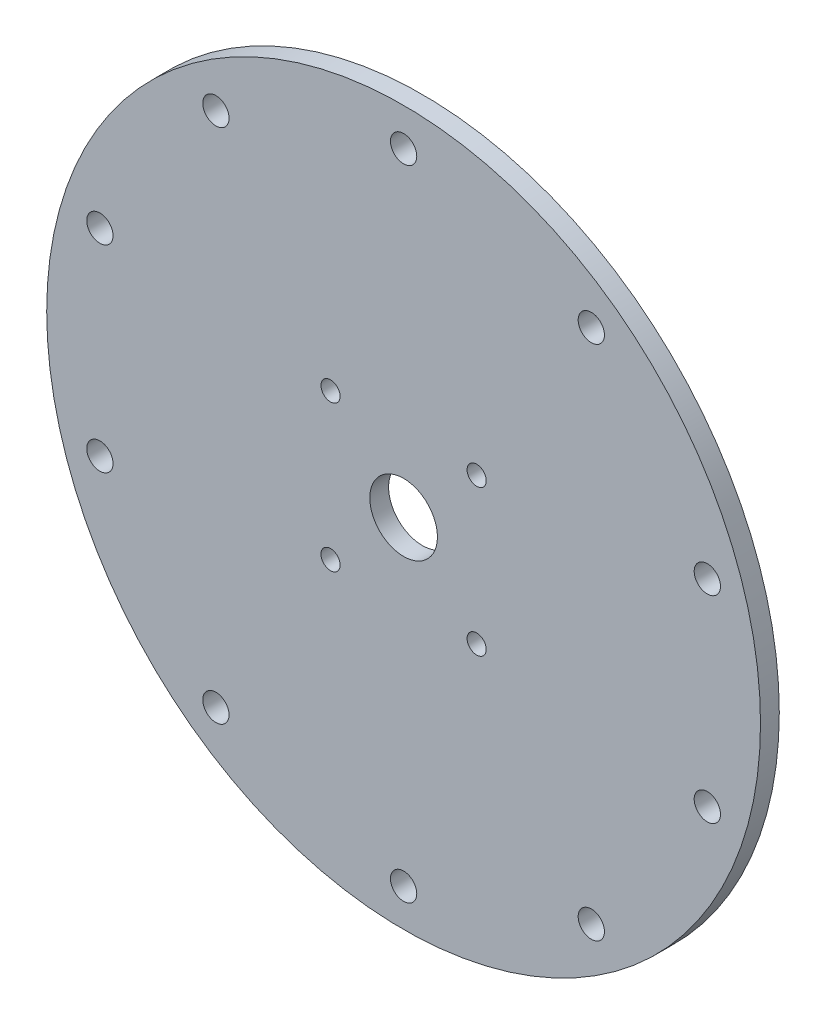
ISO-10303-21;
HEADER;
FILE_DESCRIPTION(('STEP AP214'),'2;1');
FILE_NAME('part.step','',(''),(''),'','','');
FILE_SCHEMA(('AUTOMOTIVE_DESIGN { 1 0 10303 214 1 1 1 1 }'));
ENDSEC;
DATA;
#1=APPLICATION_CONTEXT('core data for automotive mechanical design processes');
#2=APPLICATION_PROTOCOL_DEFINITION('international standard','automotive_design',2000,#1);
#3=PRODUCT_CONTEXT('',#1,'mechanical');
#4=PRODUCT('Part','Part','',(#3));
#5=PRODUCT_RELATED_PRODUCT_CATEGORY('part','',(#4));
#6=PRODUCT_DEFINITION_FORMATION('','',#4);
#7=PRODUCT_DEFINITION_CONTEXT('part definition',#1,'design');
#8=PRODUCT_DEFINITION('design','',#6,#7);
#9=PRODUCT_DEFINITION_SHAPE('','',#8);
#10=(LENGTH_UNIT() NAMED_UNIT(*) SI_UNIT(.MILLI.,.METRE.));
#11=(NAMED_UNIT(*) PLANE_ANGLE_UNIT() SI_UNIT($,.RADIAN.));
#12=(NAMED_UNIT(*) SI_UNIT($,.STERADIAN.) SOLID_ANGLE_UNIT());
#13=UNCERTAINTY_MEASURE_WITH_UNIT(LENGTH_MEASURE(1.E-05),#10,'distance_accuracy_value','');
#14=(GEOMETRIC_REPRESENTATION_CONTEXT(3) GLOBAL_UNCERTAINTY_ASSIGNED_CONTEXT((#13)) GLOBAL_UNIT_ASSIGNED_CONTEXT((#10,
#11,#12)) REPRESENTATION_CONTEXT('',''));
#15=CARTESIAN_POINT('',(0.,0.,0.));
#16=DIRECTION('',(0.,0.,1.));
#17=DIRECTION('',(1.,0.,0.));
#18=AXIS2_PLACEMENT_3D('',#15,#16,#17);
#19=CARTESIAN_POINT('',(0.,0.,10.));
#20=DIRECTION('',(0.,0.,1.));
#21=DIRECTION('',(1.,0.,0.));
#22=AXIS2_PLACEMENT_3D('',#19,#20,#21);
#23=PLANE('',#22);
#24=CARTESIAN_POINT('',(38.8908729652601,-38.8908729652601,10.));
#25=DIRECTION('',(0.,0.,1.));
#26=DIRECTION('',(1.,0.,0.));
#27=AXIS2_PLACEMENT_3D('',#24,#25,#26);
#28=CIRCLE('',#27,5.1);
#29=CARTESIAN_POINT('',(43.9908729652601,-38.8908729652601,10.));
#30=VERTEX_POINT('',#29);
#31=EDGE_CURVE('E120',#30,#30,#28,.T.);
#32=ORIENTED_EDGE('',*,*,#31,.F.);
#33=EDGE_LOOP('',(#32));
#34=FACE_BOUND('',#33,.T.);
#35=CARTESIAN_POINT('',(38.8908729652601,38.8908729652601,10.));
#36=DIRECTION('',(0.,0.,1.));
#37=DIRECTION('',(1.,0.,0.));
#38=AXIS2_PLACEMENT_3D('',#35,#36,#37);
#39=CIRCLE('',#38,5.1);
#40=CARTESIAN_POINT('',(43.9908729652601,38.8908729652601,10.));
#41=VERTEX_POINT('',#40);
#42=EDGE_CURVE('E108',#41,#41,#39,.T.);
#43=ORIENTED_EDGE('',*,*,#42,.F.);
#44=EDGE_LOOP('',(#43));
#45=FACE_BOUND('',#44,.T.);
#46=CARTESIAN_POINT('',(99.9234928897205,137.532889043741,10.));
#47=DIRECTION('',(0.,0.,1.));
#48=DIRECTION('',(1.,0.,0.));
#49=AXIS2_PLACEMENT_3D('',#46,#47,#48);
#50=CIRCLE('',#49,6.99999999999781);
#51=CARTESIAN_POINT('',(106.923492889718,137.532889043741,10.));
#52=VERTEX_POINT('',#51);
#53=EDGE_CURVE('E96',#52,#52,#50,.T.);
#54=ORIENTED_EDGE('',*,*,#53,.F.);
#55=EDGE_LOOP('',(#54));
#56=FACE_BOUND('',#55,.T.);
#57=CARTESIAN_POINT('',(161.679607770176,-52.5328890437411,10.));
#58=DIRECTION('',(0.,0.,1.));
#59=DIRECTION('',(1.,0.,0.));
#60=AXIS2_PLACEMENT_3D('',#57,#58,#59);
#61=CIRCLE('',#60,6.99999999999841);
#62=CARTESIAN_POINT('',(168.679607770175,-52.5328890437411,10.));
#63=VERTEX_POINT('',#62);
#64=EDGE_CURVE('E84',#63,#63,#61,.T.);
#65=ORIENTED_EDGE('',*,*,#64,.F.);
#66=EDGE_LOOP('',(#65));
#67=FACE_BOUND('',#66,.T.);
#68=CARTESIAN_POINT('',(0.,-170.,10.));
#69=DIRECTION('',(0.,0.,1.));
#70=DIRECTION('',(1.,0.,0.));
#71=AXIS2_PLACEMENT_3D('',#68,#69,#70);
#72=CIRCLE('',#71,6.99999999999884);
#73=CARTESIAN_POINT('',(6.9999999999988,-170.,10.));
#74=VERTEX_POINT('',#73);
#75=EDGE_CURVE('E72',#74,#74,#72,.T.);
#76=ORIENTED_EDGE('',*,*,#75,.F.);
#77=EDGE_LOOP('',(#76));
#78=FACE_BOUND('',#77,.T.);
#79=CARTESIAN_POINT('',(-161.679607770176,-52.532889043741,10.));
#80=DIRECTION('',(0.,0.,1.));
#81=DIRECTION('',(1.,0.,0.));
#82=AXIS2_PLACEMENT_3D('',#79,#80,#81);
#83=CIRCLE('',#82,6.9999999999993);
#84=CARTESIAN_POINT('',(-154.679607770177,-52.532889043741,10.));
#85=VERTEX_POINT('',#84);
#86=EDGE_CURVE('E60',#85,#85,#83,.T.);
#87=ORIENTED_EDGE('',*,*,#86,.F.);
#88=EDGE_LOOP('',(#87));
#89=FACE_BOUND('',#88,.T.);
#90=CARTESIAN_POINT('',(-99.9234928897204,137.532889043741,10.));
#91=DIRECTION('',(0.,0.,1.));
#92=DIRECTION('',(1.,0.,0.));
#93=AXIS2_PLACEMENT_3D('',#90,#91,#92);
#94=CIRCLE('',#93,6.99999999999977);
#95=CARTESIAN_POINT('',(-92.9234928897207,137.532889043741,10.));
#96=VERTEX_POINT('',#95);
#97=EDGE_CURVE('E48',#96,#96,#94,.T.);
#98=ORIENTED_EDGE('',*,*,#97,.F.);
#99=EDGE_LOOP('',(#98));
#100=FACE_BOUND('',#99,.T.);
#101=CARTESIAN_POINT('',(0.,0.,10.));
#102=DIRECTION('',(0.,0.,1.));
#103=DIRECTION('',(1.,0.,0.));
#104=AXIS2_PLACEMENT_3D('',#101,#102,#103);
#105=CIRCLE('',#104,190.);
#106=CARTESIAN_POINT('',(190.,0.,10.));
#107=VERTEX_POINT('',#106);
#108=EDGE_CURVE('E10',#107,#107,#105,.T.);
#109=ORIENTED_EDGE('',*,*,#108,.T.);
#110=EDGE_LOOP('',(#109));
#111=FACE_BOUND('',#110,.T.);
#112=CARTESIAN_POINT('',(0.,170.,10.));
#113=DIRECTION('',(0.,0.,1.));
#114=DIRECTION('',(1.,0.,0.));
#115=AXIS2_PLACEMENT_3D('',#112,#113,#114);
#116=CIRCLE('',#115,7.);
#117=CARTESIAN_POINT('',(7.,170.,10.));
#118=VERTEX_POINT('',#117);
#119=EDGE_CURVE('E43',#118,#118,#116,.T.);
#120=ORIENTED_EDGE('',*,*,#119,.F.);
#121=EDGE_LOOP('',(#120));
#122=FACE_BOUND('',#121,.T.);
#123=CARTESIAN_POINT('',(-161.679607770176,52.5328890437411,10.));
#124=DIRECTION('',(0.,0.,1.));
#125=DIRECTION('',(1.,0.,0.));
#126=AXIS2_PLACEMENT_3D('',#123,#124,#125);
#127=CIRCLE('',#126,6.99999999999954);
#128=CARTESIAN_POINT('',(-154.679607770177,52.5328890437411,10.));
#129=VERTEX_POINT('',#128);
#130=EDGE_CURVE('E54',#129,#129,#127,.T.);
#131=ORIENTED_EDGE('',*,*,#130,.F.);
#132=EDGE_LOOP('',(#131));
#133=FACE_BOUND('',#132,.T.);
#134=CARTESIAN_POINT('',(-99.9234928897205,-137.532889043741,10.));
#135=DIRECTION('',(0.,0.,1.));
#136=DIRECTION('',(1.,0.,0.));
#137=AXIS2_PLACEMENT_3D('',#134,#135,#136);
#138=CIRCLE('',#137,6.99999999999905);
#139=CARTESIAN_POINT('',(-92.9234928897214,-137.532889043741,10.));
#140=VERTEX_POINT('',#139);
#141=EDGE_CURVE('E66',#140,#140,#138,.T.);
#142=ORIENTED_EDGE('',*,*,#141,.F.);
#143=EDGE_LOOP('',(#142));
#144=FACE_BOUND('',#143,.T.);
#145=CARTESIAN_POINT('',(99.9234928897204,-137.532889043741,10.));
#146=DIRECTION('',(0.,0.,1.));
#147=DIRECTION('',(1.,0.,0.));
#148=AXIS2_PLACEMENT_3D('',#145,#146,#147);
#149=CIRCLE('',#148,6.99999999999855);
#150=CARTESIAN_POINT('',(106.923492889719,-137.532889043741,10.));
#151=VERTEX_POINT('',#150);
#152=EDGE_CURVE('E78',#151,#151,#149,.T.);
#153=ORIENTED_EDGE('',*,*,#152,.F.);
#154=EDGE_LOOP('',(#153));
#155=FACE_BOUND('',#154,.T.);
#156=CARTESIAN_POINT('',(161.679607770176,52.532889043741,10.));
#157=DIRECTION('',(0.,0.,1.));
#158=DIRECTION('',(1.,0.,0.));
#159=AXIS2_PLACEMENT_3D('',#156,#157,#158);
#160=CIRCLE('',#159,6.99999999999811);
#161=CARTESIAN_POINT('',(168.679607770174,52.532889043741,10.));
#162=VERTEX_POINT('',#161);
#163=EDGE_CURVE('E90',#162,#162,#160,.T.);
#164=ORIENTED_EDGE('',*,*,#163,.F.);
#165=EDGE_LOOP('',(#164));
#166=FACE_BOUND('',#165,.T.);
#167=CARTESIAN_POINT('',(0.,0.,10.));
#168=DIRECTION('',(0.,0.,1.));
#169=DIRECTION('',(1.,0.,0.));
#170=AXIS2_PLACEMENT_3D('',#167,#168,#169);
#171=CIRCLE('',#170,18.);
#172=CARTESIAN_POINT('',(18.,0.,10.));
#173=VERTEX_POINT('',#172);
#174=EDGE_CURVE('E102',#173,#173,#171,.T.);
#175=ORIENTED_EDGE('',*,*,#174,.F.);
#176=EDGE_LOOP('',(#175));
#177=FACE_BOUND('',#176,.T.);
#178=CARTESIAN_POINT('',(-38.8908729652601,38.8908729652601,10.));
#179=DIRECTION('',(0.,0.,1.));
#180=DIRECTION('',(1.,0.,0.));
#181=AXIS2_PLACEMENT_3D('',#178,#179,#180);
#182=CIRCLE('',#181,5.1);
#183=CARTESIAN_POINT('',(-33.7908729652601,38.8908729652601,10.));
#184=VERTEX_POINT('',#183);
#185=EDGE_CURVE('E114',#184,#184,#182,.T.);
#186=ORIENTED_EDGE('',*,*,#185,.F.);
#187=EDGE_LOOP('',(#186));
#188=FACE_BOUND('',#187,.T.);
#189=CARTESIAN_POINT('',(-38.8908729652601,-38.8908729652601,10.));
#190=DIRECTION('',(0.,0.,1.));
#191=DIRECTION('',(1.,0.,0.));
#192=AXIS2_PLACEMENT_3D('',#189,#190,#191);
#193=CIRCLE('',#192,5.1);
#194=CARTESIAN_POINT('',(-33.7908729652601,-38.8908729652601,10.));
#195=VERTEX_POINT('',#194);
#196=EDGE_CURVE('E126',#195,#195,#193,.T.);
#197=ORIENTED_EDGE('',*,*,#196,.F.);
#198=EDGE_LOOP('',(#197));
#199=FACE_BOUND('',#198,.T.);
#200=ADVANCED_FACE('F32',(#34,#45,#56,#67,#78,#89,#100,#111,#122,#133,#144,#155,#166,#177,#188,
#199),#23,.T.);
#201=CARTESIAN_POINT('',(0.,0.,0.));
#202=DIRECTION('',(0.,0.,1.));
#203=DIRECTION('',(1.,0.,0.));
#204=AXIS2_PLACEMENT_3D('',#201,#202,#203);
#205=PLANE('',#204);
#206=CARTESIAN_POINT('',(0.,0.,0.));
#207=DIRECTION('',(0.,0.,1.));
#208=DIRECTION('',(1.,0.,0.));
#209=AXIS2_PLACEMENT_3D('',#206,#207,#208);
#210=CIRCLE('',#209,190.);
#211=CARTESIAN_POINT('',(190.,0.,0.));
#212=VERTEX_POINT('',#211);
#213=EDGE_CURVE('E36',#212,#212,#210,.T.);
#214=ORIENTED_EDGE('',*,*,#213,.F.);
#215=EDGE_LOOP('',(#214));
#216=FACE_BOUND('',#215,.T.);
#217=CARTESIAN_POINT('',(0.,170.,0.));
#218=DIRECTION('',(0.,0.,1.));
#219=DIRECTION('',(1.,0.,0.));
#220=AXIS2_PLACEMENT_3D('',#217,#218,#219);
#221=CIRCLE('',#220,7.);
#222=CARTESIAN_POINT('',(7.,170.,0.));
#223=VERTEX_POINT('',#222);
#224=EDGE_CURVE('E45',#223,#223,#221,.T.);
#225=ORIENTED_EDGE('',*,*,#224,.T.);
#226=EDGE_LOOP('',(#225));
#227=FACE_BOUND('',#226,.T.);
#228=CARTESIAN_POINT('',(-99.9234928897204,137.532889043741,0.));
#229=DIRECTION('',(0.,0.,1.));
#230=DIRECTION('',(1.,0.,0.));
#231=AXIS2_PLACEMENT_3D('',#228,#229,#230);
#232=CIRCLE('',#231,6.99999999999977);
#233=CARTESIAN_POINT('',(-92.9234928897207,137.532889043741,0.));
#234=VERTEX_POINT('',#233);
#235=EDGE_CURVE('E51',#234,#234,#232,.T.);
#236=ORIENTED_EDGE('',*,*,#235,.T.);
#237=EDGE_LOOP('',(#236));
#238=FACE_BOUND('',#237,.T.);
#239=CARTESIAN_POINT('',(-161.679607770176,52.5328890437411,0.));
#240=DIRECTION('',(0.,0.,1.));
#241=DIRECTION('',(1.,0.,0.));
#242=AXIS2_PLACEMENT_3D('',#239,#240,#241);
#243=CIRCLE('',#242,6.99999999999954);
#244=CARTESIAN_POINT('',(-154.679607770177,52.5328890437411,0.));
#245=VERTEX_POINT('',#244);
#246=EDGE_CURVE('E57',#245,#245,#243,.T.);
#247=ORIENTED_EDGE('',*,*,#246,.T.);
#248=EDGE_LOOP('',(#247));
#249=FACE_BOUND('',#248,.T.);
#250=CARTESIAN_POINT('',(-161.679607770176,-52.532889043741,0.));
#251=DIRECTION('',(0.,0.,1.));
#252=DIRECTION('',(1.,0.,0.));
#253=AXIS2_PLACEMENT_3D('',#250,#251,#252);
#254=CIRCLE('',#253,6.9999999999993);
#255=CARTESIAN_POINT('',(-154.679607770177,-52.532889043741,0.));
#256=VERTEX_POINT('',#255);
#257=EDGE_CURVE('E63',#256,#256,#254,.T.);
#258=ORIENTED_EDGE('',*,*,#257,.T.);
#259=EDGE_LOOP('',(#258));
#260=FACE_BOUND('',#259,.T.);
#261=CARTESIAN_POINT('',(-99.9234928897205,-137.532889043741,0.));
#262=DIRECTION('',(0.,0.,1.));
#263=DIRECTION('',(1.,0.,0.));
#264=AXIS2_PLACEMENT_3D('',#261,#262,#263);
#265=CIRCLE('',#264,6.99999999999905);
#266=CARTESIAN_POINT('',(-92.9234928897214,-137.532889043741,0.));
#267=VERTEX_POINT('',#266);
#268=EDGE_CURVE('E69',#267,#267,#265,.T.);
#269=ORIENTED_EDGE('',*,*,#268,.T.);
#270=EDGE_LOOP('',(#269));
#271=FACE_BOUND('',#270,.T.);
#272=CARTESIAN_POINT('',(0.,-170.,0.));
#273=DIRECTION('',(0.,0.,1.));
#274=DIRECTION('',(1.,0.,0.));
#275=AXIS2_PLACEMENT_3D('',#272,#273,#274);
#276=CIRCLE('',#275,6.99999999999884);
#277=CARTESIAN_POINT('',(6.9999999999988,-170.,0.));
#278=VERTEX_POINT('',#277);
#279=EDGE_CURVE('E75',#278,#278,#276,.T.);
#280=ORIENTED_EDGE('',*,*,#279,.T.);
#281=EDGE_LOOP('',(#280));
#282=FACE_BOUND('',#281,.T.);
#283=CARTESIAN_POINT('',(99.9234928897204,-137.532889043741,0.));
#284=DIRECTION('',(0.,0.,1.));
#285=DIRECTION('',(1.,0.,0.));
#286=AXIS2_PLACEMENT_3D('',#283,#284,#285);
#287=CIRCLE('',#286,6.99999999999855);
#288=CARTESIAN_POINT('',(106.923492889719,-137.532889043741,0.));
#289=VERTEX_POINT('',#288);
#290=EDGE_CURVE('E81',#289,#289,#287,.T.);
#291=ORIENTED_EDGE('',*,*,#290,.T.);
#292=EDGE_LOOP('',(#291));
#293=FACE_BOUND('',#292,.T.);
#294=CARTESIAN_POINT('',(161.679607770176,-52.5328890437411,0.));
#295=DIRECTION('',(0.,0.,1.));
#296=DIRECTION('',(1.,0.,0.));
#297=AXIS2_PLACEMENT_3D('',#294,#295,#296);
#298=CIRCLE('',#297,6.99999999999841);
#299=CARTESIAN_POINT('',(168.679607770175,-52.5328890437411,0.));
#300=VERTEX_POINT('',#299);
#301=EDGE_CURVE('E87',#300,#300,#298,.T.);
#302=ORIENTED_EDGE('',*,*,#301,.T.);
#303=EDGE_LOOP('',(#302));
#304=FACE_BOUND('',#303,.T.);
#305=CARTESIAN_POINT('',(161.679607770176,52.532889043741,0.));
#306=DIRECTION('',(0.,0.,1.));
#307=DIRECTION('',(1.,0.,0.));
#308=AXIS2_PLACEMENT_3D('',#305,#306,#307);
#309=CIRCLE('',#308,6.99999999999811);
#310=CARTESIAN_POINT('',(168.679607770174,52.532889043741,0.));
#311=VERTEX_POINT('',#310);
#312=EDGE_CURVE('E93',#311,#311,#309,.T.);
#313=ORIENTED_EDGE('',*,*,#312,.T.);
#314=EDGE_LOOP('',(#313));
#315=FACE_BOUND('',#314,.T.);
#316=CARTESIAN_POINT('',(99.9234928897205,137.532889043741,0.));
#317=DIRECTION('',(0.,0.,1.));
#318=DIRECTION('',(1.,0.,0.));
#319=AXIS2_PLACEMENT_3D('',#316,#317,#318);
#320=CIRCLE('',#319,6.99999999999781);
#321=CARTESIAN_POINT('',(106.923492889718,137.532889043741,0.));
#322=VERTEX_POINT('',#321);
#323=EDGE_CURVE('E99',#322,#322,#320,.T.);
#324=ORIENTED_EDGE('',*,*,#323,.T.);
#325=EDGE_LOOP('',(#324));
#326=FACE_BOUND('',#325,.T.);
#327=CARTESIAN_POINT('',(0.,0.,0.));
#328=DIRECTION('',(0.,0.,1.));
#329=DIRECTION('',(1.,0.,0.));
#330=AXIS2_PLACEMENT_3D('',#327,#328,#329);
#331=CIRCLE('',#330,18.);
#332=CARTESIAN_POINT('',(18.,0.,0.));
#333=VERTEX_POINT('',#332);
#334=EDGE_CURVE('E105',#333,#333,#331,.T.);
#335=ORIENTED_EDGE('',*,*,#334,.T.);
#336=EDGE_LOOP('',(#335));
#337=FACE_BOUND('',#336,.T.);
#338=CARTESIAN_POINT('',(38.8908729652601,38.8908729652601,0.));
#339=DIRECTION('',(0.,0.,1.));
#340=DIRECTION('',(1.,0.,0.));
#341=AXIS2_PLACEMENT_3D('',#338,#339,#340);
#342=CIRCLE('',#341,5.1);
#343=CARTESIAN_POINT('',(43.9908729652601,38.8908729652601,0.));
#344=VERTEX_POINT('',#343);
#345=EDGE_CURVE('E111',#344,#344,#342,.T.);
#346=ORIENTED_EDGE('',*,*,#345,.T.);
#347=EDGE_LOOP('',(#346));
#348=FACE_BOUND('',#347,.T.);
#349=CARTESIAN_POINT('',(-38.8908729652601,38.8908729652601,0.));
#350=DIRECTION('',(0.,0.,1.));
#351=DIRECTION('',(1.,0.,0.));
#352=AXIS2_PLACEMENT_3D('',#349,#350,#351);
#353=CIRCLE('',#352,5.1);
#354=CARTESIAN_POINT('',(-33.7908729652601,38.8908729652601,0.));
#355=VERTEX_POINT('',#354);
#356=EDGE_CURVE('E117',#355,#355,#353,.T.);
#357=ORIENTED_EDGE('',*,*,#356,.T.);
#358=EDGE_LOOP('',(#357));
#359=FACE_BOUND('',#358,.T.);
#360=CARTESIAN_POINT('',(38.8908729652601,-38.8908729652601,0.));
#361=DIRECTION('',(0.,0.,1.));
#362=DIRECTION('',(1.,0.,0.));
#363=AXIS2_PLACEMENT_3D('',#360,#361,#362);
#364=CIRCLE('',#363,5.1);
#365=CARTESIAN_POINT('',(43.9908729652601,-38.8908729652601,0.));
#366=VERTEX_POINT('',#365);
#367=EDGE_CURVE('E123',#366,#366,#364,.T.);
#368=ORIENTED_EDGE('',*,*,#367,.T.);
#369=EDGE_LOOP('',(#368));
#370=FACE_BOUND('',#369,.T.);
#371=CARTESIAN_POINT('',(-38.8908729652601,-38.8908729652601,0.));
#372=DIRECTION('',(0.,0.,1.));
#373=DIRECTION('',(1.,0.,0.));
#374=AXIS2_PLACEMENT_3D('',#371,#372,#373);
#375=CIRCLE('',#374,5.1);
#376=CARTESIAN_POINT('',(-33.7908729652601,-38.8908729652601,0.));
#377=VERTEX_POINT('',#376);
#378=EDGE_CURVE('E129',#377,#377,#375,.T.);
#379=ORIENTED_EDGE('',*,*,#378,.T.);
#380=EDGE_LOOP('',(#379));
#381=FACE_BOUND('',#380,.T.);
#382=ADVANCED_FACE('F139',(#216,#227,#238,#249,#260,#271,#282,#293,#304,#315,#326,#337,#348,
#359,#370,#381),#205,.F.);
#383=CARTESIAN_POINT('',(0.,0.,10.));
#384=DIRECTION('',(0.,0.,-1.));
#385=DIRECTION('',(-1.,0.,0.));
#386=AXIS2_PLACEMENT_3D('',#383,#384,#385);
#387=CYLINDRICAL_SURFACE('',#386,190.);
#388=ORIENTED_EDGE('',*,*,#108,.F.);
#389=EDGE_LOOP('',(#388));
#390=FACE_BOUND('',#389,.T.);
#391=ORIENTED_EDGE('',*,*,#213,.T.);
#392=EDGE_LOOP('',(#391));
#393=FACE_BOUND('',#392,.T.);
#394=ADVANCED_FACE('F34',(#390,#393),#387,.T.);
#395=CARTESIAN_POINT('',(0.,170.,10.));
#396=DIRECTION('',(0.,0.,-1.));
#397=DIRECTION('',(-1.,0.,0.));
#398=AXIS2_PLACEMENT_3D('',#395,#396,#397);
#399=CYLINDRICAL_SURFACE('',#398,7.);
#400=ORIENTED_EDGE('',*,*,#119,.T.);
#401=EDGE_LOOP('',(#400));
#402=FACE_BOUND('',#401,.T.);
#403=ORIENTED_EDGE('',*,*,#224,.F.);
#404=EDGE_LOOP('',(#403));
#405=FACE_BOUND('',#404,.T.);
#406=ADVANCED_FACE('F149',(#402,#405),#399,.F.);
#407=CARTESIAN_POINT('',(-99.9234928897204,137.532889043741,10.));
#408=DIRECTION('',(0.,0.,-1.));
#409=DIRECTION('',(-1.,0.,0.));
#410=AXIS2_PLACEMENT_3D('',#407,#408,#409);
#411=CYLINDRICAL_SURFACE('',#410,6.99999999999977);
#412=ORIENTED_EDGE('',*,*,#97,.T.);
#413=EDGE_LOOP('',(#412));
#414=FACE_BOUND('',#413,.T.);
#415=ORIENTED_EDGE('',*,*,#235,.F.);
#416=EDGE_LOOP('',(#415));
#417=FACE_BOUND('',#416,.T.);
#418=ADVANCED_FACE('F152',(#414,#417),#411,.F.);
#419=CARTESIAN_POINT('',(-161.679607770176,52.5328890437411,10.));
#420=DIRECTION('',(0.,0.,-1.));
#421=DIRECTION('',(-1.,0.,0.));
#422=AXIS2_PLACEMENT_3D('',#419,#420,#421);
#423=CYLINDRICAL_SURFACE('',#422,6.99999999999954);
#424=ORIENTED_EDGE('',*,*,#130,.T.);
#425=EDGE_LOOP('',(#424));
#426=FACE_BOUND('',#425,.T.);
#427=ORIENTED_EDGE('',*,*,#246,.F.);
#428=EDGE_LOOP('',(#427));
#429=FACE_BOUND('',#428,.T.);
#430=ADVANCED_FACE('F156',(#426,#429),#423,.F.);
#431=CARTESIAN_POINT('',(-161.679607770176,-52.532889043741,10.));
#432=DIRECTION('',(0.,0.,-1.));
#433=DIRECTION('',(-1.,0.,0.));
#434=AXIS2_PLACEMENT_3D('',#431,#432,#433);
#435=CYLINDRICAL_SURFACE('',#434,6.9999999999993);
#436=ORIENTED_EDGE('',*,*,#86,.T.);
#437=EDGE_LOOP('',(#436));
#438=FACE_BOUND('',#437,.T.);
#439=ORIENTED_EDGE('',*,*,#257,.F.);
#440=EDGE_LOOP('',(#439));
#441=FACE_BOUND('',#440,.T.);
#442=ADVANCED_FACE('F160',(#438,#441),#435,.F.);
#443=CARTESIAN_POINT('',(-99.9234928897205,-137.532889043741,10.));
#444=DIRECTION('',(0.,0.,-1.));
#445=DIRECTION('',(-1.,0.,0.));
#446=AXIS2_PLACEMENT_3D('',#443,#444,#445);
#447=CYLINDRICAL_SURFACE('',#446,6.99999999999905);
#448=ORIENTED_EDGE('',*,*,#141,.T.);
#449=EDGE_LOOP('',(#448));
#450=FACE_BOUND('',#449,.T.);
#451=ORIENTED_EDGE('',*,*,#268,.F.);
#452=EDGE_LOOP('',(#451));
#453=FACE_BOUND('',#452,.T.);
#454=ADVANCED_FACE('F164',(#450,#453),#447,.F.);
#455=CARTESIAN_POINT('',(0.,-170.,10.));
#456=DIRECTION('',(0.,0.,-1.));
#457=DIRECTION('',(-1.,0.,0.));
#458=AXIS2_PLACEMENT_3D('',#455,#456,#457);
#459=CYLINDRICAL_SURFACE('',#458,6.99999999999884);
#460=ORIENTED_EDGE('',*,*,#75,.T.);
#461=EDGE_LOOP('',(#460));
#462=FACE_BOUND('',#461,.T.);
#463=ORIENTED_EDGE('',*,*,#279,.F.);
#464=EDGE_LOOP('',(#463));
#465=FACE_BOUND('',#464,.T.);
#466=ADVANCED_FACE('F168',(#462,#465),#459,.F.);
#467=CARTESIAN_POINT('',(99.9234928897204,-137.532889043741,10.));
#468=DIRECTION('',(0.,0.,-1.));
#469=DIRECTION('',(-1.,0.,0.));
#470=AXIS2_PLACEMENT_3D('',#467,#468,#469);
#471=CYLINDRICAL_SURFACE('',#470,6.99999999999855);
#472=ORIENTED_EDGE('',*,*,#152,.T.);
#473=EDGE_LOOP('',(#472));
#474=FACE_BOUND('',#473,.T.);
#475=ORIENTED_EDGE('',*,*,#290,.F.);
#476=EDGE_LOOP('',(#475));
#477=FACE_BOUND('',#476,.T.);
#478=ADVANCED_FACE('F172',(#474,#477),#471,.F.);
#479=CARTESIAN_POINT('',(161.679607770176,-52.5328890437411,10.));
#480=DIRECTION('',(0.,0.,-1.));
#481=DIRECTION('',(-1.,0.,0.));
#482=AXIS2_PLACEMENT_3D('',#479,#480,#481);
#483=CYLINDRICAL_SURFACE('',#482,6.99999999999841);
#484=ORIENTED_EDGE('',*,*,#64,.T.);
#485=EDGE_LOOP('',(#484));
#486=FACE_BOUND('',#485,.T.);
#487=ORIENTED_EDGE('',*,*,#301,.F.);
#488=EDGE_LOOP('',(#487));
#489=FACE_BOUND('',#488,.T.);
#490=ADVANCED_FACE('F176',(#486,#489),#483,.F.);
#491=CARTESIAN_POINT('',(161.679607770176,52.532889043741,10.));
#492=DIRECTION('',(0.,0.,-1.));
#493=DIRECTION('',(-1.,0.,0.));
#494=AXIS2_PLACEMENT_3D('',#491,#492,#493);
#495=CYLINDRICAL_SURFACE('',#494,6.99999999999811);
#496=ORIENTED_EDGE('',*,*,#163,.T.);
#497=EDGE_LOOP('',(#496));
#498=FACE_BOUND('',#497,.T.);
#499=ORIENTED_EDGE('',*,*,#312,.F.);
#500=EDGE_LOOP('',(#499));
#501=FACE_BOUND('',#500,.T.);
#502=ADVANCED_FACE('F180',(#498,#501),#495,.F.);
#503=CARTESIAN_POINT('',(99.9234928897205,137.532889043741,10.));
#504=DIRECTION('',(0.,0.,-1.));
#505=DIRECTION('',(-1.,0.,0.));
#506=AXIS2_PLACEMENT_3D('',#503,#504,#505);
#507=CYLINDRICAL_SURFACE('',#506,6.99999999999781);
#508=ORIENTED_EDGE('',*,*,#53,.T.);
#509=EDGE_LOOP('',(#508));
#510=FACE_BOUND('',#509,.T.);
#511=ORIENTED_EDGE('',*,*,#323,.F.);
#512=EDGE_LOOP('',(#511));
#513=FACE_BOUND('',#512,.T.);
#514=ADVANCED_FACE('F184',(#510,#513),#507,.F.);
#515=CARTESIAN_POINT('',(0.,0.,10.));
#516=DIRECTION('',(0.,0.,-1.));
#517=DIRECTION('',(-1.,0.,0.));
#518=AXIS2_PLACEMENT_3D('',#515,#516,#517);
#519=CYLINDRICAL_SURFACE('',#518,18.);
#520=ORIENTED_EDGE('',*,*,#174,.T.);
#521=EDGE_LOOP('',(#520));
#522=FACE_BOUND('',#521,.T.);
#523=ORIENTED_EDGE('',*,*,#334,.F.);
#524=EDGE_LOOP('',(#523));
#525=FACE_BOUND('',#524,.T.);
#526=ADVANCED_FACE('F188',(#522,#525),#519,.F.);
#527=CARTESIAN_POINT('',(38.8908729652601,38.8908729652601,10.));
#528=DIRECTION('',(0.,0.,-1.));
#529=DIRECTION('',(-1.,0.,0.));
#530=AXIS2_PLACEMENT_3D('',#527,#528,#529);
#531=CYLINDRICAL_SURFACE('',#530,5.1);
#532=ORIENTED_EDGE('',*,*,#42,.T.);
#533=EDGE_LOOP('',(#532));
#534=FACE_BOUND('',#533,.T.);
#535=ORIENTED_EDGE('',*,*,#345,.F.);
#536=EDGE_LOOP('',(#535));
#537=FACE_BOUND('',#536,.T.);
#538=ADVANCED_FACE('F192',(#534,#537),#531,.F.);
#539=CARTESIAN_POINT('',(-38.8908729652601,38.8908729652601,10.));
#540=DIRECTION('',(0.,0.,-1.));
#541=DIRECTION('',(-1.,0.,0.));
#542=AXIS2_PLACEMENT_3D('',#539,#540,#541);
#543=CYLINDRICAL_SURFACE('',#542,5.1);
#544=ORIENTED_EDGE('',*,*,#185,.T.);
#545=EDGE_LOOP('',(#544));
#546=FACE_BOUND('',#545,.T.);
#547=ORIENTED_EDGE('',*,*,#356,.F.);
#548=EDGE_LOOP('',(#547));
#549=FACE_BOUND('',#548,.T.);
#550=ADVANCED_FACE('F196',(#546,#549),#543,.F.);
#551=CARTESIAN_POINT('',(38.8908729652601,-38.8908729652601,10.));
#552=DIRECTION('',(0.,0.,-1.));
#553=DIRECTION('',(-1.,0.,0.));
#554=AXIS2_PLACEMENT_3D('',#551,#552,#553);
#555=CYLINDRICAL_SURFACE('',#554,5.1);
#556=ORIENTED_EDGE('',*,*,#31,.T.);
#557=EDGE_LOOP('',(#556));
#558=FACE_BOUND('',#557,.T.);
#559=ORIENTED_EDGE('',*,*,#367,.F.);
#560=EDGE_LOOP('',(#559));
#561=FACE_BOUND('',#560,.T.);
#562=ADVANCED_FACE('F200',(#558,#561),#555,.F.);
#563=CARTESIAN_POINT('',(-38.8908729652601,-38.8908729652601,10.));
#564=DIRECTION('',(0.,0.,-1.));
#565=DIRECTION('',(-1.,0.,0.));
#566=AXIS2_PLACEMENT_3D('',#563,#564,#565);
#567=CYLINDRICAL_SURFACE('',#566,5.1);
#568=ORIENTED_EDGE('',*,*,#196,.T.);
#569=EDGE_LOOP('',(#568));
#570=FACE_BOUND('',#569,.T.);
#571=ORIENTED_EDGE('',*,*,#378,.F.);
#572=EDGE_LOOP('',(#571));
#573=FACE_BOUND('',#572,.T.);
#574=ADVANCED_FACE('F135',(#570,#573),#567,.F.);
#575=CLOSED_SHELL('',(#200,#382,#394,#406,#418,#430,#442,#454,#466,#478,#490,#502,#514,#526,
#538,#550,#562,#574));
#576=MANIFOLD_SOLID_BREP('B2',#575);
#577=ADVANCED_BREP_SHAPE_REPRESENTATION('',(#18,#576),#14);
#578=SHAPE_DEFINITION_REPRESENTATION(#9,#577);
ENDSEC;
END-ISO-10303-21;
